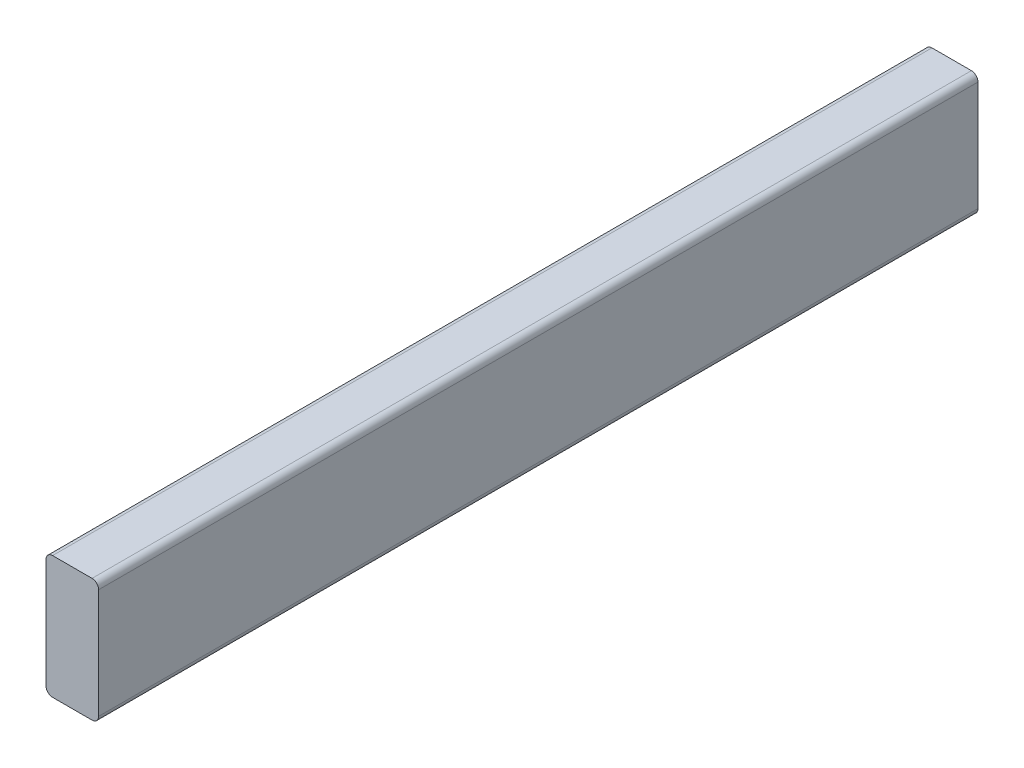
ISO-10303-21;
HEADER;
FILE_DESCRIPTION(('STEP AP214'),'2;1');
FILE_NAME('part.step','',(''),(''),'','','');
FILE_SCHEMA(('AUTOMOTIVE_DESIGN { 1 0 10303 214 1 1 1 1 }'));
ENDSEC;
DATA;
#1=APPLICATION_CONTEXT('core data for automotive mechanical design processes');
#2=APPLICATION_PROTOCOL_DEFINITION('international standard','automotive_design',2000,#1);
#3=PRODUCT_CONTEXT('',#1,'mechanical');
#4=PRODUCT('Part','Part','',(#3));
#5=PRODUCT_RELATED_PRODUCT_CATEGORY('part','',(#4));
#6=PRODUCT_DEFINITION_FORMATION('','',#4);
#7=PRODUCT_DEFINITION_CONTEXT('part definition',#1,'design');
#8=PRODUCT_DEFINITION('design','',#6,#7);
#9=PRODUCT_DEFINITION_SHAPE('','',#8);
#10=(LENGTH_UNIT() NAMED_UNIT(*) SI_UNIT(.MILLI.,.METRE.));
#11=(NAMED_UNIT(*) PLANE_ANGLE_UNIT() SI_UNIT($,.RADIAN.));
#12=(NAMED_UNIT(*) SI_UNIT($,.STERADIAN.) SOLID_ANGLE_UNIT());
#13=UNCERTAINTY_MEASURE_WITH_UNIT(LENGTH_MEASURE(1.E-05),#10,'distance_accuracy_value','');
#14=(GEOMETRIC_REPRESENTATION_CONTEXT(3) GLOBAL_UNCERTAINTY_ASSIGNED_CONTEXT((#13)) GLOBAL_UNIT_ASSIGNED_CONTEXT((#10,
#11,#12)) REPRESENTATION_CONTEXT('',''));
#15=CARTESIAN_POINT('',(0.,0.,0.));
#16=DIRECTION('',(0.,0.,1.));
#17=DIRECTION('',(1.,0.,0.));
#18=AXIS2_PLACEMENT_3D('',#15,#16,#17);
#19=CARTESIAN_POINT('',(-819.830594651005,100.80625,-733.389526516131));
#20=DIRECTION('',(-1.,0.,0.));
#21=DIRECTION('',(0.,0.,1.));
#22=AXIS2_PLACEMENT_3D('',#19,#20,#21);
#23=PLANE('',#22);
#24=DIRECTION('',(0.,1.,0.));
#25=VECTOR('',#24,1.);
#26=CARTESIAN_POINT('',(-819.830594651005,11.90625,-636.66920807166));
#27=LINE('',#26,#25);
#28=CARTESIAN_POINT('',(-819.830594651005,16.66875,-636.66920807166));
#29=VERTEX_POINT('',#28);
#30=CARTESIAN_POINT('',(-819.830594651005,96.04375,-636.66920807166));
#31=VERTEX_POINT('',#30);
#32=EDGE_CURVE('E114',#29,#31,#27,.T.);
#33=ORIENTED_EDGE('',*,*,#32,.F.);
#34=DIRECTION('',(0.,0.,1.));
#35=VECTOR('',#34,1.);
#36=CARTESIAN_POINT('',(-819.830594651005,16.66875,-733.389526516131));
#37=LINE('',#36,#35);
#38=CARTESIAN_POINT('',(-819.830594651005,16.66875,0.));
#39=VERTEX_POINT('',#38);
#40=EDGE_CURVE('E127',#29,#39,#37,.T.);
#41=ORIENTED_EDGE('',*,*,#40,.T.);
#42=DIRECTION('',(0.,-1.,0.));
#43=VECTOR('',#42,1.);
#44=CARTESIAN_POINT('',(-819.830594651005,100.80625,0.));
#45=LINE('',#44,#43);
#46=CARTESIAN_POINT('',(-819.830594651005,96.04375,0.));
#47=VERTEX_POINT('',#46);
#48=EDGE_CURVE('E177',#47,#39,#45,.T.);
#49=ORIENTED_EDGE('',*,*,#48,.F.);
#50=DIRECTION('',(0.,0.,1.));
#51=VECTOR('',#50,1.);
#52=CARTESIAN_POINT('',(-819.830594651005,96.04375,-733.389526516131));
#53=LINE('',#52,#51);
#54=EDGE_CURVE('E130',#47,#31,#53,.F.);
#55=ORIENTED_EDGE('',*,*,#54,.T.);
#56=EDGE_LOOP('',(#33,#41,#49,#55));
#57=FACE_BOUND('',#56,.T.);
#58=ADVANCED_FACE('F44',(#57),#23,.T.);
#59=CARTESIAN_POINT('',(-819.830594651005,100.80625,-733.389526516131));
#60=DIRECTION('',(0.,1.,0.));
#61=DIRECTION('',(0.,0.,1.));
#62=AXIS2_PLACEMENT_3D('',#59,#60,#61);
#63=PLANE('',#62);
#64=DIRECTION('',(1.,0.,0.));
#65=VECTOR('',#64,1.);
#66=CARTESIAN_POINT('',(-819.830594651005,100.80625,-636.66920807166));
#67=LINE('',#66,#65);
#68=CARTESIAN_POINT('',(-815.068094651005,100.80625,-636.66920807166));
#69=VERTEX_POINT('',#68);
#70=CARTESIAN_POINT('',(-786.493094651005,100.80625,-636.66920807166));
#71=VERTEX_POINT('',#70);
#72=EDGE_CURVE('E131',#69,#71,#67,.T.);
#73=ORIENTED_EDGE('',*,*,#72,.F.);
#74=DIRECTION('',(0.,0.,1.));
#75=VECTOR('',#74,1.);
#76=CARTESIAN_POINT('',(-815.068094651005,100.80625,-733.389526516131));
#77=LINE('',#76,#75);
#78=CARTESIAN_POINT('',(-815.068094651005,100.80625,0.));
#79=VERTEX_POINT('',#78);
#80=EDGE_CURVE('E13',#69,#79,#77,.T.);
#81=ORIENTED_EDGE('',*,*,#80,.T.);
#82=DIRECTION('',(-1.,0.,0.));
#83=VECTOR('',#82,1.);
#84=CARTESIAN_POINT('',(-819.830594651005,100.80625,0.));
#85=LINE('',#84,#83);
#86=CARTESIAN_POINT('',(-786.493094651005,100.80625,0.));
#87=VERTEX_POINT('',#86);
#88=EDGE_CURVE('E132',#87,#79,#85,.T.);
#89=ORIENTED_EDGE('',*,*,#88,.F.);
#90=DIRECTION('',(0.,0.,1.));
#91=VECTOR('',#90,1.);
#92=CARTESIAN_POINT('',(-786.493094651005,100.80625,-733.389526516131));
#93=LINE('',#92,#91);
#94=EDGE_CURVE('E52',#87,#71,#93,.F.);
#95=ORIENTED_EDGE('',*,*,#94,.T.);
#96=EDGE_LOOP('',(#73,#81,#89,#95));
#97=FACE_BOUND('',#96,.T.);
#98=ADVANCED_FACE('F161',(#97),#63,.T.);
#99=CARTESIAN_POINT('',(-781.730594651005,100.80625,-733.389526516131));
#100=DIRECTION('',(1.,0.,0.));
#101=DIRECTION('',(0.,0.,-1.));
#102=AXIS2_PLACEMENT_3D('',#99,#100,#101);
#103=PLANE('',#102);
#104=DIRECTION('',(0.,1.,0.));
#105=VECTOR('',#104,1.);
#106=CARTESIAN_POINT('',(-781.730594651005,100.80625,0.));
#107=LINE('',#106,#105);
#108=CARTESIAN_POINT('',(-781.730594651005,16.66875,0.));
#109=VERTEX_POINT('',#108);
#110=CARTESIAN_POINT('',(-781.730594651005,96.04375,0.));
#111=VERTEX_POINT('',#110);
#112=EDGE_CURVE('E170',#109,#111,#107,.T.);
#113=ORIENTED_EDGE('',*,*,#112,.F.);
#114=DIRECTION('',(0.,0.,1.));
#115=VECTOR('',#114,1.);
#116=CARTESIAN_POINT('',(-781.730594651005,16.66875,-733.389526516131));
#117=LINE('',#116,#115);
#118=CARTESIAN_POINT('',(-781.730594651005,16.66875,-636.66920807166));
#119=VERTEX_POINT('',#118);
#120=EDGE_CURVE('E59',#109,#119,#117,.F.);
#121=ORIENTED_EDGE('',*,*,#120,.T.);
#122=DIRECTION('',(0.,-1.,0.));
#123=VECTOR('',#122,1.);
#124=CARTESIAN_POINT('',(-781.730594651005,11.90625,-636.66920807166));
#125=LINE('',#124,#123);
#126=CARTESIAN_POINT('',(-781.730594651005,96.04375,-636.66920807166));
#127=VERTEX_POINT('',#126);
#128=EDGE_CURVE('E165',#127,#119,#125,.T.);
#129=ORIENTED_EDGE('',*,*,#128,.F.);
#130=DIRECTION('',(0.,0.,1.));
#131=VECTOR('',#130,1.);
#132=CARTESIAN_POINT('',(-781.730594651005,96.04375,-733.389526516131));
#133=LINE('',#132,#131);
#134=EDGE_CURVE('E121',#127,#111,#133,.T.);
#135=ORIENTED_EDGE('',*,*,#134,.T.);
#136=EDGE_LOOP('',(#113,#121,#129,#135));
#137=FACE_BOUND('',#136,.T.);
#138=ADVANCED_FACE('F169',(#137),#103,.T.);
#139=CARTESIAN_POINT('',(-819.830594651005,11.90625,-733.389526516131));
#140=DIRECTION('',(0.,-1.,0.));
#141=DIRECTION('',(0.,0.,-1.));
#142=AXIS2_PLACEMENT_3D('',#139,#140,#141);
#143=PLANE('',#142);
#144=DIRECTION('',(1.,0.,0.));
#145=VECTOR('',#144,1.);
#146=CARTESIAN_POINT('',(-819.830594651005,11.90625,0.));
#147=LINE('',#146,#145);
#148=CARTESIAN_POINT('',(-815.068094651005,11.90625,0.));
#149=VERTEX_POINT('',#148);
#150=CARTESIAN_POINT('',(-786.493094651005,11.90625,0.));
#151=VERTEX_POINT('',#150);
#152=EDGE_CURVE('E174',#149,#151,#147,.T.);
#153=ORIENTED_EDGE('',*,*,#152,.F.);
#154=DIRECTION('',(0.,0.,1.));
#155=VECTOR('',#154,1.);
#156=CARTESIAN_POINT('',(-815.068094651005,11.90625,-733.389526516131));
#157=LINE('',#156,#155);
#158=CARTESIAN_POINT('',(-815.068094651005,11.90625,-636.66920807166));
#159=VERTEX_POINT('',#158);
#160=EDGE_CURVE('E149',#149,#159,#157,.F.);
#161=ORIENTED_EDGE('',*,*,#160,.T.);
#162=DIRECTION('',(-1.,0.,0.));
#163=VECTOR('',#162,1.);
#164=CARTESIAN_POINT('',(-819.830594651005,11.90625,-636.66920807166));
#165=LINE('',#164,#163);
#166=CARTESIAN_POINT('',(-786.493094651005,11.90625,-636.66920807166));
#167=VERTEX_POINT('',#166);
#168=EDGE_CURVE('E117',#167,#159,#165,.T.);
#169=ORIENTED_EDGE('',*,*,#168,.F.);
#170=DIRECTION('',(0.,0.,1.));
#171=VECTOR('',#170,1.);
#172=CARTESIAN_POINT('',(-786.493094651005,11.90625,-733.389526516131));
#173=LINE('',#172,#171);
#174=EDGE_CURVE('E146',#167,#151,#173,.T.);
#175=ORIENTED_EDGE('',*,*,#174,.T.);
#176=EDGE_LOOP('',(#153,#161,#169,#175));
#177=FACE_BOUND('',#176,.T.);
#178=ADVANCED_FACE('F188',(#177),#143,.T.);
#179=CARTESIAN_POINT('',(0.,0.,0.));
#180=DIRECTION('',(0.,0.,1.));
#181=DIRECTION('',(1.,0.,0.));
#182=AXIS2_PLACEMENT_3D('',#179,#180,#181);
#183=PLANE('',#182);
#184=ORIENTED_EDGE('',*,*,#48,.T.);
#185=CARTESIAN_POINT('',(-815.068094651005,16.66875,0.));
#186=DIRECTION('',(0.,0.,1.));
#187=DIRECTION('',(1.,0.,0.));
#188=AXIS2_PLACEMENT_3D('',#185,#186,#187);
#189=CIRCLE('',#188,4.7625);
#190=EDGE_CURVE('E135',#39,#149,#189,.T.);
#191=ORIENTED_EDGE('',*,*,#190,.T.);
#192=ORIENTED_EDGE('',*,*,#152,.T.);
#193=CARTESIAN_POINT('',(-786.493094651005,16.66875,0.));
#194=DIRECTION('',(0.,0.,1.));
#195=DIRECTION('',(1.,0.,0.));
#196=AXIS2_PLACEMENT_3D('',#193,#194,#195);
#197=CIRCLE('',#196,4.7625);
#198=EDGE_CURVE('E143',#151,#109,#197,.T.);
#199=ORIENTED_EDGE('',*,*,#198,.T.);
#200=ORIENTED_EDGE('',*,*,#112,.T.);
#201=CARTESIAN_POINT('',(-786.493094651005,96.04375,0.));
#202=DIRECTION('',(0.,0.,1.));
#203=DIRECTION('',(1.,0.,0.));
#204=AXIS2_PLACEMENT_3D('',#201,#202,#203);
#205=CIRCLE('',#204,4.7625);
#206=EDGE_CURVE('E136',#111,#87,#205,.T.);
#207=ORIENTED_EDGE('',*,*,#206,.T.);
#208=ORIENTED_EDGE('',*,*,#88,.T.);
#209=CARTESIAN_POINT('',(-815.068094651005,96.04375,0.));
#210=DIRECTION('',(0.,0.,1.));
#211=DIRECTION('',(1.,0.,0.));
#212=AXIS2_PLACEMENT_3D('',#209,#210,#211);
#213=CIRCLE('',#212,4.7625);
#214=EDGE_CURVE('E138',#79,#47,#213,.T.);
#215=ORIENTED_EDGE('',*,*,#214,.T.);
#216=EDGE_LOOP('',(#184,#191,#192,#199,#200,#207,#208,#215));
#217=FACE_BOUND('',#216,.T.);
#218=ADVANCED_FACE('F172',(#217),#183,.T.);
#219=CARTESIAN_POINT('',(0.,0.,-636.66920807166));
#220=DIRECTION('',(0.,0.,1.));
#221=DIRECTION('',(-1.,0.,0.));
#222=AXIS2_PLACEMENT_3D('',#219,#220,#221);
#223=PLANE('',#222);
#224=ORIENTED_EDGE('',*,*,#168,.T.);
#225=CARTESIAN_POINT('',(-815.068094651005,16.66875,-636.66920807166));
#226=DIRECTION('',(0.,0.,1.));
#227=DIRECTION('',(1.,0.,0.));
#228=AXIS2_PLACEMENT_3D('',#225,#226,#227);
#229=CIRCLE('',#228,4.7625);
#230=EDGE_CURVE('E111',#159,#29,#229,.F.);
#231=ORIENTED_EDGE('',*,*,#230,.T.);
#232=ORIENTED_EDGE('',*,*,#32,.T.);
#233=CARTESIAN_POINT('',(-815.068094651005,96.04375,-636.66920807166));
#234=DIRECTION('',(0.,0.,1.));
#235=DIRECTION('',(1.,0.,0.));
#236=AXIS2_PLACEMENT_3D('',#233,#234,#235);
#237=CIRCLE('',#236,4.7625);
#238=EDGE_CURVE('E152',#31,#69,#237,.F.);
#239=ORIENTED_EDGE('',*,*,#238,.T.);
#240=ORIENTED_EDGE('',*,*,#72,.T.);
#241=CARTESIAN_POINT('',(-786.493094651005,96.04375,-636.66920807166));
#242=DIRECTION('',(0.,0.,1.));
#243=DIRECTION('',(1.,0.,0.));
#244=AXIS2_PLACEMENT_3D('',#241,#242,#243);
#245=CIRCLE('',#244,4.7625);
#246=EDGE_CURVE('E66',#71,#127,#245,.F.);
#247=ORIENTED_EDGE('',*,*,#246,.T.);
#248=ORIENTED_EDGE('',*,*,#128,.T.);
#249=CARTESIAN_POINT('',(-786.493094651005,16.66875,-636.66920807166));
#250=DIRECTION('',(0.,0.,1.));
#251=DIRECTION('',(1.,0.,0.));
#252=AXIS2_PLACEMENT_3D('',#249,#250,#251);
#253=CIRCLE('',#252,4.7625);
#254=EDGE_CURVE('E122',#119,#167,#253,.F.);
#255=ORIENTED_EDGE('',*,*,#254,.T.);
#256=EDGE_LOOP('',(#224,#231,#232,#239,#240,#247,#248,#255));
#257=FACE_BOUND('',#256,.T.);
#258=ADVANCED_FACE('F113',(#257),#223,.F.);
#259=CARTESIAN_POINT('',(-815.068094651005,16.66875,-733.389526516131));
#260=DIRECTION('',(0.,0.,1.));
#261=DIRECTION('',(1.,0.,0.));
#262=AXIS2_PLACEMENT_3D('',#259,#260,#261);
#263=CYLINDRICAL_SURFACE('',#262,4.7625);
#264=ORIENTED_EDGE('',*,*,#230,.F.);
#265=ORIENTED_EDGE('',*,*,#160,.F.);
#266=ORIENTED_EDGE('',*,*,#190,.F.);
#267=ORIENTED_EDGE('',*,*,#40,.F.);
#268=EDGE_LOOP('',(#264,#265,#266,#267));
#269=FACE_BOUND('',#268,.T.);
#270=ADVANCED_FACE('F134',(#269),#263,.T.);
#271=CARTESIAN_POINT('',(-786.493094651005,16.66875,-733.389526516131));
#272=DIRECTION('',(0.,0.,1.));
#273=DIRECTION('',(1.,0.,0.));
#274=AXIS2_PLACEMENT_3D('',#271,#272,#273);
#275=CYLINDRICAL_SURFACE('',#274,4.7625);
#276=ORIENTED_EDGE('',*,*,#254,.F.);
#277=ORIENTED_EDGE('',*,*,#120,.F.);
#278=ORIENTED_EDGE('',*,*,#198,.F.);
#279=ORIENTED_EDGE('',*,*,#174,.F.);
#280=EDGE_LOOP('',(#276,#277,#278,#279));
#281=FACE_BOUND('',#280,.T.);
#282=ADVANCED_FACE('F185',(#281),#275,.T.);
#283=CARTESIAN_POINT('',(-815.068094651005,96.04375,-733.389526516131));
#284=DIRECTION('',(0.,0.,1.));
#285=DIRECTION('',(1.,0.,0.));
#286=AXIS2_PLACEMENT_3D('',#283,#284,#285);
#287=CYLINDRICAL_SURFACE('',#286,4.7625);
#288=ORIENTED_EDGE('',*,*,#238,.F.);
#289=ORIENTED_EDGE('',*,*,#54,.F.);
#290=ORIENTED_EDGE('',*,*,#214,.F.);
#291=ORIENTED_EDGE('',*,*,#80,.F.);
#292=EDGE_LOOP('',(#288,#289,#290,#291));
#293=FACE_BOUND('',#292,.T.);
#294=ADVANCED_FACE('F190',(#293),#287,.T.);
#295=CARTESIAN_POINT('',(-786.493094651005,96.04375,-733.389526516131));
#296=DIRECTION('',(0.,0.,1.));
#297=DIRECTION('',(1.,0.,0.));
#298=AXIS2_PLACEMENT_3D('',#295,#296,#297);
#299=CYLINDRICAL_SURFACE('',#298,4.7625);
#300=ORIENTED_EDGE('',*,*,#246,.F.);
#301=ORIENTED_EDGE('',*,*,#94,.F.);
#302=ORIENTED_EDGE('',*,*,#206,.F.);
#303=ORIENTED_EDGE('',*,*,#134,.F.);
#304=EDGE_LOOP('',(#300,#301,#302,#303));
#305=FACE_BOUND('',#304,.T.);
#306=ADVANCED_FACE('F46',(#305),#299,.T.);
#307=CLOSED_SHELL('',(#58,#98,#138,#178,#218,#258,#270,#282,#294,#306));
#308=MANIFOLD_SOLID_BREP('B2',#307);
#309=ADVANCED_BREP_SHAPE_REPRESENTATION('',(#18,#308),#14);
#310=SHAPE_DEFINITION_REPRESENTATION(#9,#309);
ENDSEC;
END-ISO-10303-21;
